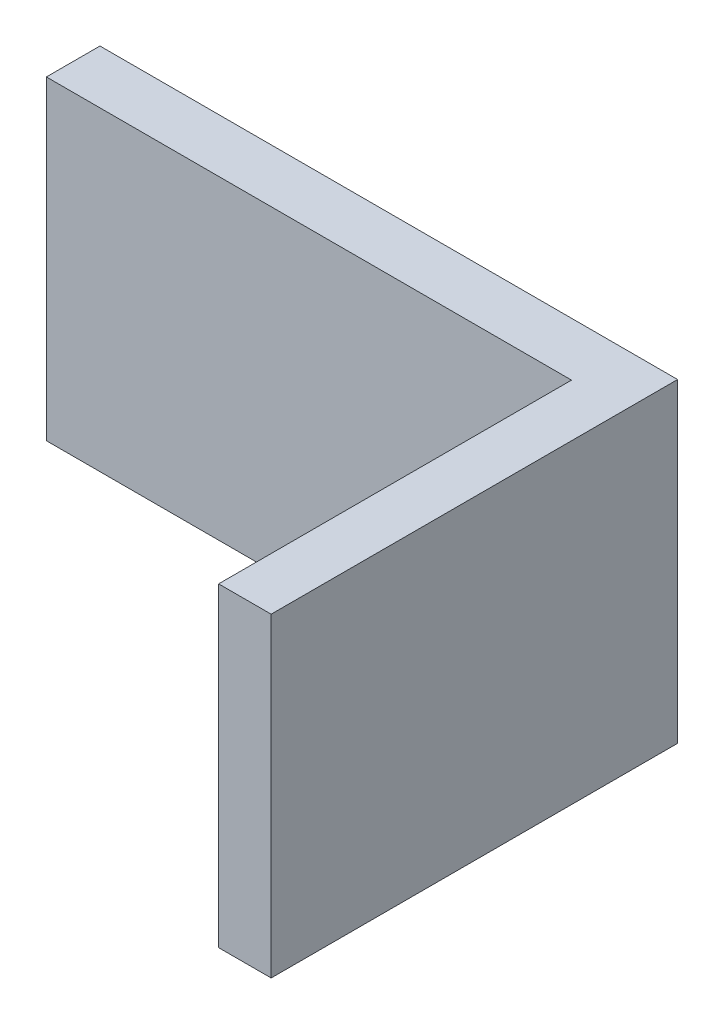
ISO-10303-21;
HEADER;
FILE_DESCRIPTION(('STEP AP214'),'2;1');
FILE_NAME('part.step','',(''),(''),'','','');
FILE_SCHEMA(('AUTOMOTIVE_DESIGN { 1 0 10303 214 1 1 1 1 }'));
ENDSEC;
DATA;
#1=APPLICATION_CONTEXT('core data for automotive mechanical design processes');
#2=APPLICATION_PROTOCOL_DEFINITION('international standard','automotive_design',2000,#1);
#3=PRODUCT_CONTEXT('',#1,'mechanical');
#4=PRODUCT('Part','Part','',(#3));
#5=PRODUCT_RELATED_PRODUCT_CATEGORY('part','',(#4));
#6=PRODUCT_DEFINITION_FORMATION('','',#4);
#7=PRODUCT_DEFINITION_CONTEXT('part definition',#1,'design');
#8=PRODUCT_DEFINITION('design','',#6,#7);
#9=PRODUCT_DEFINITION_SHAPE('','',#8);
#10=(LENGTH_UNIT() NAMED_UNIT(*) SI_UNIT(.MILLI.,.METRE.));
#11=(NAMED_UNIT(*) PLANE_ANGLE_UNIT() SI_UNIT($,.RADIAN.));
#12=(NAMED_UNIT(*) SI_UNIT($,.STERADIAN.) SOLID_ANGLE_UNIT());
#13=UNCERTAINTY_MEASURE_WITH_UNIT(LENGTH_MEASURE(1.E-05),#10,'distance_accuracy_value','');
#14=(GEOMETRIC_REPRESENTATION_CONTEXT(3) GLOBAL_UNCERTAINTY_ASSIGNED_CONTEXT((#13)) GLOBAL_UNIT_ASSIGNED_CONTEXT((#10,
#11,#12)) REPRESENTATION_CONTEXT('',''));
#15=CARTESIAN_POINT('',(0.,0.,0.));
#16=DIRECTION('',(0.,0.,1.));
#17=DIRECTION('',(1.,0.,0.));
#18=AXIS2_PLACEMENT_3D('',#15,#16,#17);
#19=CARTESIAN_POINT('',(4.55,-0.1,0.));
#20=DIRECTION('',(0.,1.,0.));
#21=DIRECTION('',(0.,0.,1.));
#22=AXIS2_PLACEMENT_3D('',#19,#20,#21);
#23=PLANE('',#22);
#24=DIRECTION('',(1.,0.,0.));
#25=VECTOR('',#24,1.);
#26=CARTESIAN_POINT('',(4.,-0.1,0.));
#27=LINE('',#26,#25);
#28=CARTESIAN_POINT('',(4.,-0.1,0.));
#29=VERTEX_POINT('',#28);
#30=CARTESIAN_POINT('',(4.55,-0.1,0.));
#31=VERTEX_POINT('',#30);
#32=EDGE_CURVE('E11',#29,#31,#27,.T.);
#33=ORIENTED_EDGE('',*,*,#32,.F.);
#34=DIRECTION('',(0.,0.,-1.));
#35=VECTOR('',#34,1.);
#36=CARTESIAN_POINT('',(4.,-0.1,0.051));
#37=LINE('',#36,#35);
#38=CARTESIAN_POINT('',(4.,-0.1,0.051));
#39=VERTEX_POINT('',#38);
#40=EDGE_CURVE('E24',#39,#29,#37,.T.);
#41=ORIENTED_EDGE('',*,*,#40,.F.);
#42=DIRECTION('',(-1.,0.,0.));
#43=VECTOR('',#42,1.);
#44=CARTESIAN_POINT('',(4.5,-0.1,0.051));
#45=LINE('',#44,#43);
#46=CARTESIAN_POINT('',(4.5,-0.1,0.051));
#47=VERTEX_POINT('',#46);
#48=EDGE_CURVE('E87',#47,#39,#45,.T.);
#49=ORIENTED_EDGE('',*,*,#48,.F.);
#50=DIRECTION('',(0.,0.,-1.));
#51=VECTOR('',#50,1.);
#52=CARTESIAN_POINT('',(4.5,-0.1,0.387));
#53=LINE('',#52,#51);
#54=CARTESIAN_POINT('',(4.5,-0.1,0.387));
#55=VERTEX_POINT('',#54);
#56=EDGE_CURVE('E114',#55,#47,#53,.T.);
#57=ORIENTED_EDGE('',*,*,#56,.F.);
#58=DIRECTION('',(-1.,0.,0.));
#59=VECTOR('',#58,1.);
#60=CARTESIAN_POINT('',(4.55,-0.1,0.387));
#61=LINE('',#60,#59);
#62=CARTESIAN_POINT('',(4.55,-0.1,0.387));
#63=VERTEX_POINT('',#62);
#64=EDGE_CURVE('E111',#63,#55,#61,.T.);
#65=ORIENTED_EDGE('',*,*,#64,.F.);
#66=DIRECTION('',(0.,0.,1.));
#67=VECTOR('',#66,1.);
#68=CARTESIAN_POINT('',(4.55,-0.1,0.));
#69=LINE('',#68,#67);
#70=EDGE_CURVE('E108',#31,#63,#69,.T.);
#71=ORIENTED_EDGE('',*,*,#70,.F.);
#72=EDGE_LOOP('',(#33,#41,#49,#57,#65,#71));
#73=FACE_BOUND('',#72,.T.);
#74=ADVANCED_FACE('F17',(#73),#23,.T.);
#75=CARTESIAN_POINT('',(4.,-0.4,0.));
#76=DIRECTION('',(0.,-1.,0.));
#77=DIRECTION('',(0.,0.,1.));
#78=AXIS2_PLACEMENT_3D('',#75,#76,#77);
#79=PLANE('',#78);
#80=DIRECTION('',(-1.,0.,0.));
#81=VECTOR('',#80,1.);
#82=CARTESIAN_POINT('',(4.55,-0.4,0.));
#83=LINE('',#82,#81);
#84=CARTESIAN_POINT('',(4.55,-0.4,0.));
#85=VERTEX_POINT('',#84);
#86=CARTESIAN_POINT('',(4.,-0.4,0.));
#87=VERTEX_POINT('',#86);
#88=EDGE_CURVE('E106',#85,#87,#83,.T.);
#89=ORIENTED_EDGE('',*,*,#88,.F.);
#90=DIRECTION('',(0.,0.,-1.));
#91=VECTOR('',#90,1.);
#92=CARTESIAN_POINT('',(4.55,-0.4,0.387));
#93=LINE('',#92,#91);
#94=CARTESIAN_POINT('',(4.55,-0.4,0.387));
#95=VERTEX_POINT('',#94);
#96=EDGE_CURVE('E103',#95,#85,#93,.T.);
#97=ORIENTED_EDGE('',*,*,#96,.F.);
#98=DIRECTION('',(1.,0.,0.));
#99=VECTOR('',#98,1.);
#100=CARTESIAN_POINT('',(4.5,-0.4,0.387));
#101=LINE('',#100,#99);
#102=CARTESIAN_POINT('',(4.5,-0.4,0.387));
#103=VERTEX_POINT('',#102);
#104=EDGE_CURVE('E100',#103,#95,#101,.T.);
#105=ORIENTED_EDGE('',*,*,#104,.F.);
#106=DIRECTION('',(0.,0.,1.));
#107=VECTOR('',#106,1.);
#108=CARTESIAN_POINT('',(4.5,-0.4,0.051));
#109=LINE('',#108,#107);
#110=CARTESIAN_POINT('',(4.5,-0.4,0.051));
#111=VERTEX_POINT('',#110);
#112=EDGE_CURVE('E72',#111,#103,#109,.T.);
#113=ORIENTED_EDGE('',*,*,#112,.F.);
#114=DIRECTION('',(1.,0.,0.));
#115=VECTOR('',#114,1.);
#116=CARTESIAN_POINT('',(4.,-0.4,0.051));
#117=LINE('',#116,#115);
#118=CARTESIAN_POINT('',(4.,-0.4,0.051));
#119=VERTEX_POINT('',#118);
#120=EDGE_CURVE('E66',#119,#111,#117,.T.);
#121=ORIENTED_EDGE('',*,*,#120,.F.);
#122=DIRECTION('',(0.,0.,1.));
#123=VECTOR('',#122,1.);
#124=CARTESIAN_POINT('',(4.,-0.4,0.));
#125=LINE('',#124,#123);
#126=EDGE_CURVE('E69',#87,#119,#125,.T.);
#127=ORIENTED_EDGE('',*,*,#126,.F.);
#128=EDGE_LOOP('',(#89,#97,#105,#113,#121,#127));
#129=FACE_BOUND('',#128,.T.);
#130=ADVANCED_FACE('F68',(#129),#79,.T.);
#131=CARTESIAN_POINT('',(4.55,-0.1,0.387));
#132=DIRECTION('',(0.,0.,1.));
#133=DIRECTION('',(0.,1.,0.));
#134=AXIS2_PLACEMENT_3D('',#131,#132,#133);
#135=PLANE('',#134);
#136=ORIENTED_EDGE('',*,*,#64,.T.);
#137=DIRECTION('',(0.,1.,0.));
#138=VECTOR('',#137,1.);
#139=CARTESIAN_POINT('',(4.5,-0.4,0.387));
#140=LINE('',#139,#138);
#141=EDGE_CURVE('E83',#103,#55,#140,.T.);
#142=ORIENTED_EDGE('',*,*,#141,.F.);
#143=ORIENTED_EDGE('',*,*,#104,.T.);
#144=DIRECTION('',(0.,-1.,0.));
#145=VECTOR('',#144,1.);
#146=CARTESIAN_POINT('',(4.55,-0.1,0.387));
#147=LINE('',#146,#145);
#148=EDGE_CURVE('E88',#63,#95,#147,.T.);
#149=ORIENTED_EDGE('',*,*,#148,.F.);
#150=EDGE_LOOP('',(#136,#142,#143,#149));
#151=FACE_BOUND('',#150,.T.);
#152=ADVANCED_FACE('F125',(#151),#135,.T.);
#153=CARTESIAN_POINT('',(4.5,-0.1,0.051));
#154=DIRECTION('',(0.,0.,1.));
#155=DIRECTION('',(0.,1.,0.));
#156=AXIS2_PLACEMENT_3D('',#153,#154,#155);
#157=PLANE('',#156);
#158=ORIENTED_EDGE('',*,*,#48,.T.);
#159=DIRECTION('',(0.,1.,0.));
#160=VECTOR('',#159,1.);
#161=CARTESIAN_POINT('',(4.,-0.4,0.051));
#162=LINE('',#161,#160);
#163=EDGE_CURVE('E81',#119,#39,#162,.T.);
#164=ORIENTED_EDGE('',*,*,#163,.F.);
#165=ORIENTED_EDGE('',*,*,#120,.T.);
#166=DIRECTION('',(0.,-1.,0.));
#167=VECTOR('',#166,1.);
#168=CARTESIAN_POINT('',(4.5,-0.1,0.051));
#169=LINE('',#168,#167);
#170=EDGE_CURVE('E89',#47,#111,#169,.T.);
#171=ORIENTED_EDGE('',*,*,#170,.F.);
#172=EDGE_LOOP('',(#158,#164,#165,#171));
#173=FACE_BOUND('',#172,.T.);
#174=ADVANCED_FACE('F86',(#173),#157,.T.);
#175=CARTESIAN_POINT('',(4.55,-0.4,0.));
#176=DIRECTION('',(1.,0.,0.));
#177=DIRECTION('',(0.,0.,1.));
#178=AXIS2_PLACEMENT_3D('',#175,#176,#177);
#179=PLANE('',#178);
#180=DIRECTION('',(0.,-1.,0.));
#181=VECTOR('',#180,1.);
#182=CARTESIAN_POINT('',(4.55,-0.1,0.));
#183=LINE('',#182,#181);
#184=EDGE_CURVE('E93',#31,#85,#183,.T.);
#185=ORIENTED_EDGE('',*,*,#184,.F.);
#186=ORIENTED_EDGE('',*,*,#70,.T.);
#187=ORIENTED_EDGE('',*,*,#148,.T.);
#188=ORIENTED_EDGE('',*,*,#96,.T.);
#189=EDGE_LOOP('',(#185,#186,#187,#188));
#190=FACE_BOUND('',#189,.T.);
#191=ADVANCED_FACE('F121',(#190),#179,.T.);
#192=CARTESIAN_POINT('',(4.,-0.1,0.));
#193=DIRECTION('',(-1.,0.,0.));
#194=DIRECTION('',(0.,0.,1.));
#195=AXIS2_PLACEMENT_3D('',#192,#193,#194);
#196=PLANE('',#195);
#197=DIRECTION('',(0.,1.,0.));
#198=VECTOR('',#197,1.);
#199=CARTESIAN_POINT('',(4.,-0.4,0.));
#200=LINE('',#199,#198);
#201=EDGE_CURVE('E82',#87,#29,#200,.T.);
#202=ORIENTED_EDGE('',*,*,#201,.F.);
#203=ORIENTED_EDGE('',*,*,#126,.T.);
#204=ORIENTED_EDGE('',*,*,#163,.T.);
#205=ORIENTED_EDGE('',*,*,#40,.T.);
#206=EDGE_LOOP('',(#202,#203,#204,#205));
#207=FACE_BOUND('',#206,.T.);
#208=ADVANCED_FACE('F80',(#207),#196,.T.);
#209=CARTESIAN_POINT('',(4.5,-0.1,0.051));
#210=DIRECTION('',(-1.,0.,0.));
#211=DIRECTION('',(0.,0.,1.));
#212=AXIS2_PLACEMENT_3D('',#209,#210,#211);
#213=PLANE('',#212);
#214=ORIENTED_EDGE('',*,*,#170,.T.);
#215=ORIENTED_EDGE('',*,*,#112,.T.);
#216=ORIENTED_EDGE('',*,*,#141,.T.);
#217=ORIENTED_EDGE('',*,*,#56,.T.);
#218=EDGE_LOOP('',(#214,#215,#216,#217));
#219=FACE_BOUND('',#218,.T.);
#220=ADVANCED_FACE('F127',(#219),#213,.T.);
#221=CARTESIAN_POINT('',(4.55,-0.4,0.));
#222=DIRECTION('',(0.,0.,-1.));
#223=DIRECTION('',(0.,1.,0.));
#224=AXIS2_PLACEMENT_3D('',#221,#222,#223);
#225=PLANE('',#224);
#226=ORIENTED_EDGE('',*,*,#88,.T.);
#227=ORIENTED_EDGE('',*,*,#201,.T.);
#228=ORIENTED_EDGE('',*,*,#32,.T.);
#229=ORIENTED_EDGE('',*,*,#184,.T.);
#230=EDGE_LOOP('',(#226,#227,#228,#229));
#231=FACE_BOUND('',#230,.T.);
#232=ADVANCED_FACE('F117',(#231),#225,.T.);
#233=CLOSED_SHELL('',(#74,#130,#152,#174,#191,#208,#220,#232));
#234=MANIFOLD_SOLID_BREP('B1',#233);
#235=ADVANCED_BREP_SHAPE_REPRESENTATION('',(#18,#234),#14);
#236=SHAPE_DEFINITION_REPRESENTATION(#9,#235);
ENDSEC;
END-ISO-10303-21;
